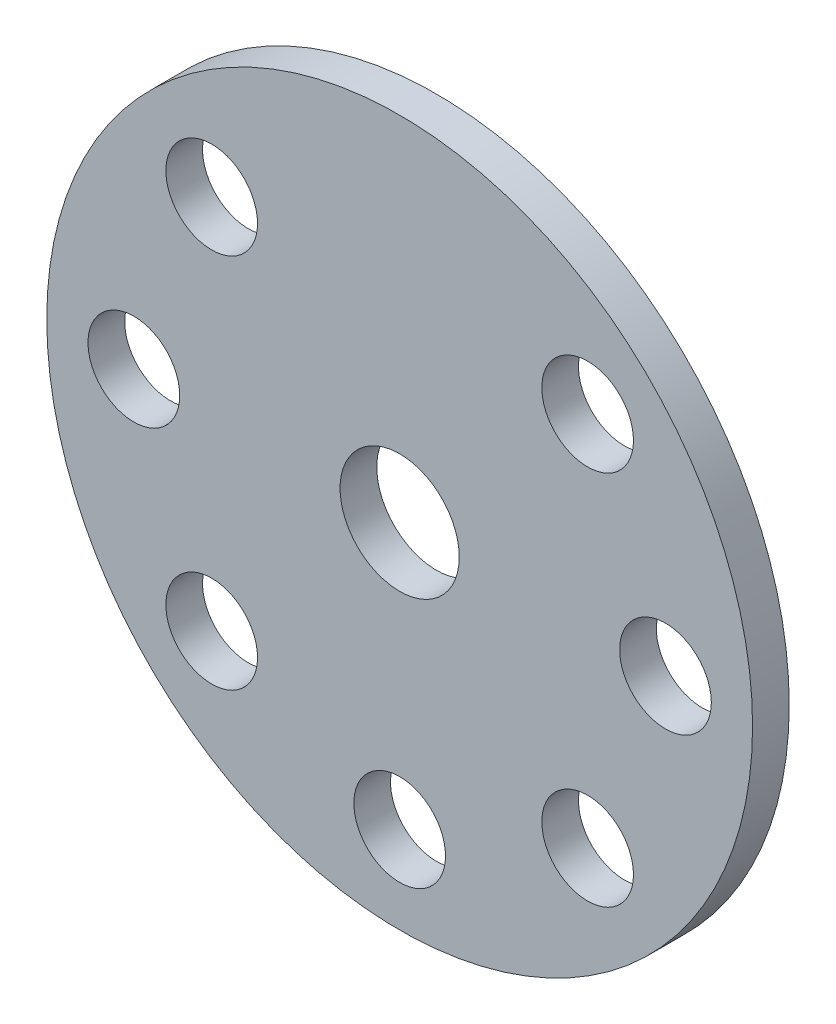
ISO-10303-21;
HEADER;
FILE_DESCRIPTION(('STEP AP214'),'2;1');
FILE_NAME('part.step','',(''),(''),'','','');
FILE_SCHEMA(('AUTOMOTIVE_DESIGN { 1 0 10303 214 1 1 1 1 }'));
ENDSEC;
DATA;
#1=APPLICATION_CONTEXT('core data for automotive mechanical design processes');
#2=APPLICATION_PROTOCOL_DEFINITION('international standard','automotive_design',2000,#1);
#3=PRODUCT_CONTEXT('',#1,'mechanical');
#4=PRODUCT('Part','Part','',(#3));
#5=PRODUCT_RELATED_PRODUCT_CATEGORY('part','',(#4));
#6=PRODUCT_DEFINITION_FORMATION('','',#4);
#7=PRODUCT_DEFINITION_CONTEXT('part definition',#1,'design');
#8=PRODUCT_DEFINITION('design','',#6,#7);
#9=PRODUCT_DEFINITION_SHAPE('','',#8);
#10=(LENGTH_UNIT() NAMED_UNIT(*) SI_UNIT(.MILLI.,.METRE.));
#11=(NAMED_UNIT(*) PLANE_ANGLE_UNIT() SI_UNIT($,.RADIAN.));
#12=(NAMED_UNIT(*) SI_UNIT($,.STERADIAN.) SOLID_ANGLE_UNIT());
#13=UNCERTAINTY_MEASURE_WITH_UNIT(LENGTH_MEASURE(1.E-05),#10,'distance_accuracy_value','');
#14=(GEOMETRIC_REPRESENTATION_CONTEXT(3) GLOBAL_UNCERTAINTY_ASSIGNED_CONTEXT((#13)) GLOBAL_UNIT_ASSIGNED_CONTEXT((#10,
#11,#12)) REPRESENTATION_CONTEXT('',''));
#15=CARTESIAN_POINT('',(0.,0.,0.));
#16=DIRECTION('',(0.,0.,1.));
#17=DIRECTION('',(1.,0.,0.));
#18=AXIS2_PLACEMENT_3D('',#15,#16,#17);
#19=CARTESIAN_POINT('',(0.,0.,2.));
#20=DIRECTION('',(0.,0.,-1.));
#21=DIRECTION('',(-1.,0.,0.));
#22=AXIS2_PLACEMENT_3D('',#19,#20,#21);
#23=CYLINDRICAL_SURFACE('',#22,19.25);
#24=CARTESIAN_POINT('',(0.,0.,2.));
#25=DIRECTION('',(0.,0.,1.));
#26=DIRECTION('',(1.,0.,0.));
#27=AXIS2_PLACEMENT_3D('',#24,#25,#26);
#28=CIRCLE('',#27,19.25);
#29=CARTESIAN_POINT('',(19.25,0.,2.));
#30=VERTEX_POINT('',#29);
#31=EDGE_CURVE('E10',#30,#30,#28,.T.);
#32=ORIENTED_EDGE('',*,*,#31,.F.);
#33=EDGE_LOOP('',(#32));
#34=FACE_BOUND('',#33,.T.);
#35=CARTESIAN_POINT('',(0.,0.,0.));
#36=DIRECTION('',(0.,0.,1.));
#37=DIRECTION('',(1.,0.,0.));
#38=AXIS2_PLACEMENT_3D('',#35,#36,#37);
#39=CIRCLE('',#38,19.25);
#40=CARTESIAN_POINT('',(19.25,0.,0.));
#41=VERTEX_POINT('',#40);
#42=EDGE_CURVE('E37',#41,#41,#39,.T.);
#43=ORIENTED_EDGE('',*,*,#42,.T.);
#44=EDGE_LOOP('',(#43));
#45=FACE_BOUND('',#44,.T.);
#46=ADVANCED_FACE('F34',(#34,#45),#23,.T.);
#47=CARTESIAN_POINT('',(0.,0.,2.));
#48=DIRECTION('',(0.,0.,1.));
#49=DIRECTION('',(1.,0.,0.));
#50=AXIS2_PLACEMENT_3D('',#47,#48,#49);
#51=PLANE('',#50);
#52=CARTESIAN_POINT('',(0.,0.,2.));
#53=DIRECTION('',(0.,0.,1.));
#54=DIRECTION('',(1.,0.,0.));
#55=AXIS2_PLACEMENT_3D('',#52,#53,#54);
#56=CIRCLE('',#55,3.25);
#57=CARTESIAN_POINT('',(3.25,0.,2.));
#58=VERTEX_POINT('',#57);
#59=EDGE_CURVE('E101',#58,#58,#56,.T.);
#60=ORIENTED_EDGE('',*,*,#59,.F.);
#61=EDGE_LOOP('',(#60));
#62=FACE_BOUND('',#61,.T.);
#63=CARTESIAN_POINT('',(10.2530483272049,10.2530483272049,2.));
#64=DIRECTION('',(0.,0.,1.));
#65=DIRECTION('',(1.,0.,0.));
#66=AXIS2_PLACEMENT_3D('',#63,#64,#65);
#67=CIRCLE('',#66,2.5);
#68=CARTESIAN_POINT('',(12.7530483272049,10.2530483272049,2.));
#69=VERTEX_POINT('',#68);
#70=EDGE_CURVE('E93',#69,#69,#67,.T.);
#71=ORIENTED_EDGE('',*,*,#70,.F.);
#72=EDGE_LOOP('',(#71));
#73=FACE_BOUND('',#72,.T.);
#74=CARTESIAN_POINT('',(14.5,0.,2.));
#75=DIRECTION('',(0.,0.,1.));
#76=DIRECTION('',(1.,0.,0.));
#77=AXIS2_PLACEMENT_3D('',#74,#75,#76);
#78=CIRCLE('',#77,2.5);
#79=CARTESIAN_POINT('',(17.,0.,2.));
#80=VERTEX_POINT('',#79);
#81=EDGE_CURVE('E87',#80,#80,#78,.T.);
#82=ORIENTED_EDGE('',*,*,#81,.F.);
#83=EDGE_LOOP('',(#82));
#84=FACE_BOUND('',#83,.T.);
#85=CARTESIAN_POINT('',(10.2530483272049,-10.2530483272049,2.));
#86=DIRECTION('',(0.,0.,1.));
#87=DIRECTION('',(1.,0.,0.));
#88=AXIS2_PLACEMENT_3D('',#85,#86,#87);
#89=CIRCLE('',#88,2.5);
#90=CARTESIAN_POINT('',(12.7530483272049,-10.2530483272049,2.));
#91=VERTEX_POINT('',#90);
#92=EDGE_CURVE('E79',#91,#91,#89,.T.);
#93=ORIENTED_EDGE('',*,*,#92,.F.);
#94=EDGE_LOOP('',(#93));
#95=FACE_BOUND('',#94,.T.);
#96=CARTESIAN_POINT('',(0.,-14.5,2.));
#97=DIRECTION('',(0.,0.,1.));
#98=DIRECTION('',(1.,0.,0.));
#99=AXIS2_PLACEMENT_3D('',#96,#97,#98);
#100=CIRCLE('',#99,2.5);
#101=CARTESIAN_POINT('',(2.50000000000001,-14.5,2.));
#102=VERTEX_POINT('',#101);
#103=EDGE_CURVE('E73',#102,#102,#100,.T.);
#104=ORIENTED_EDGE('',*,*,#103,.F.);
#105=EDGE_LOOP('',(#104));
#106=FACE_BOUND('',#105,.T.);
#107=CARTESIAN_POINT('',(-10.2530483272049,-10.2530483272049,2.));
#108=DIRECTION('',(0.,0.,1.));
#109=DIRECTION('',(1.,0.,0.));
#110=AXIS2_PLACEMENT_3D('',#107,#108,#109);
#111=CIRCLE('',#110,2.5);
#112=CARTESIAN_POINT('',(-7.75304832720493,-10.2530483272049,2.));
#113=VERTEX_POINT('',#112);
#114=EDGE_CURVE('E65',#113,#113,#111,.T.);
#115=ORIENTED_EDGE('',*,*,#114,.F.);
#116=EDGE_LOOP('',(#115));
#117=FACE_BOUND('',#116,.T.);
#118=CARTESIAN_POINT('',(-14.5,0.,2.));
#119=DIRECTION('',(0.,0.,1.));
#120=DIRECTION('',(1.,0.,0.));
#121=AXIS2_PLACEMENT_3D('',#118,#119,#120);
#122=CIRCLE('',#121,2.5);
#123=CARTESIAN_POINT('',(-12.,0.,2.));
#124=VERTEX_POINT('',#123);
#125=EDGE_CURVE('E57',#124,#124,#122,.T.);
#126=ORIENTED_EDGE('',*,*,#125,.F.);
#127=EDGE_LOOP('',(#126));
#128=FACE_BOUND('',#127,.T.);
#129=CARTESIAN_POINT('',(-10.2530483272049,10.2530483272049,2.));
#130=DIRECTION('',(0.,0.,1.));
#131=DIRECTION('',(1.,0.,0.));
#132=AXIS2_PLACEMENT_3D('',#129,#130,#131);
#133=CIRCLE('',#132,2.5);
#134=CARTESIAN_POINT('',(-7.75304832720493,10.2530483272049,2.));
#135=VERTEX_POINT('',#134);
#136=EDGE_CURVE('E51',#135,#135,#133,.T.);
#137=ORIENTED_EDGE('',*,*,#136,.F.);
#138=EDGE_LOOP('',(#137));
#139=FACE_BOUND('',#138,.T.);
#140=ORIENTED_EDGE('',*,*,#31,.T.);
#141=EDGE_LOOP('',(#140));
#142=FACE_BOUND('',#141,.T.);
#143=ADVANCED_FACE('F118',(#62,#73,#84,#95,#106,#117,#128,#139,#142),#51,.T.);
#144=CARTESIAN_POINT('',(0.,0.,0.));
#145=DIRECTION('',(0.,0.,1.));
#146=DIRECTION('',(1.,0.,0.));
#147=AXIS2_PLACEMENT_3D('',#144,#145,#146);
#148=PLANE('',#147);
#149=CARTESIAN_POINT('',(0.,0.,0.));
#150=DIRECTION('',(0.,0.,1.));
#151=DIRECTION('',(1.,0.,0.));
#152=AXIS2_PLACEMENT_3D('',#149,#150,#151);
#153=CIRCLE('',#152,3.25);
#154=CARTESIAN_POINT('',(3.25,0.,0.));
#155=VERTEX_POINT('',#154);
#156=EDGE_CURVE('E97',#155,#155,#153,.T.);
#157=ORIENTED_EDGE('',*,*,#156,.T.);
#158=EDGE_LOOP('',(#157));
#159=FACE_BOUND('',#158,.T.);
#160=CARTESIAN_POINT('',(10.2530483272049,10.2530483272049,0.));
#161=DIRECTION('',(0.,0.,1.));
#162=DIRECTION('',(1.,0.,0.));
#163=AXIS2_PLACEMENT_3D('',#160,#161,#162);
#164=CIRCLE('',#163,2.5);
#165=CARTESIAN_POINT('',(12.7530483272049,10.2530483272049,0.));
#166=VERTEX_POINT('',#165);
#167=EDGE_CURVE('E90',#166,#166,#164,.T.);
#168=ORIENTED_EDGE('',*,*,#167,.T.);
#169=EDGE_LOOP('',(#168));
#170=FACE_BOUND('',#169,.T.);
#171=CARTESIAN_POINT('',(14.5,0.,0.));
#172=DIRECTION('',(0.,0.,1.));
#173=DIRECTION('',(1.,0.,0.));
#174=AXIS2_PLACEMENT_3D('',#171,#172,#173);
#175=CIRCLE('',#174,2.5);
#176=CARTESIAN_POINT('',(17.,0.,0.));
#177=VERTEX_POINT('',#176);
#178=EDGE_CURVE('E83',#177,#177,#175,.T.);
#179=ORIENTED_EDGE('',*,*,#178,.T.);
#180=EDGE_LOOP('',(#179));
#181=FACE_BOUND('',#180,.T.);
#182=CARTESIAN_POINT('',(10.2530483272049,-10.2530483272049,0.));
#183=DIRECTION('',(0.,0.,1.));
#184=DIRECTION('',(1.,0.,0.));
#185=AXIS2_PLACEMENT_3D('',#182,#183,#184);
#186=CIRCLE('',#185,2.5);
#187=CARTESIAN_POINT('',(12.7530483272049,-10.2530483272049,0.));
#188=VERTEX_POINT('',#187);
#189=EDGE_CURVE('E76',#188,#188,#186,.T.);
#190=ORIENTED_EDGE('',*,*,#189,.T.);
#191=EDGE_LOOP('',(#190));
#192=FACE_BOUND('',#191,.T.);
#193=CARTESIAN_POINT('',(0.,-14.5,0.));
#194=DIRECTION('',(0.,0.,1.));
#195=DIRECTION('',(1.,0.,0.));
#196=AXIS2_PLACEMENT_3D('',#193,#194,#195);
#197=CIRCLE('',#196,2.5);
#198=CARTESIAN_POINT('',(2.50000000000001,-14.5,0.));
#199=VERTEX_POINT('',#198);
#200=EDGE_CURVE('E69',#199,#199,#197,.T.);
#201=ORIENTED_EDGE('',*,*,#200,.T.);
#202=EDGE_LOOP('',(#201));
#203=FACE_BOUND('',#202,.T.);
#204=CARTESIAN_POINT('',(-10.2530483272049,-10.2530483272049,0.));
#205=DIRECTION('',(0.,0.,1.));
#206=DIRECTION('',(1.,0.,0.));
#207=AXIS2_PLACEMENT_3D('',#204,#205,#206);
#208=CIRCLE('',#207,2.5);
#209=CARTESIAN_POINT('',(-7.75304832720493,-10.2530483272049,0.));
#210=VERTEX_POINT('',#209);
#211=EDGE_CURVE('E61',#210,#210,#208,.T.);
#212=ORIENTED_EDGE('',*,*,#211,.T.);
#213=EDGE_LOOP('',(#212));
#214=FACE_BOUND('',#213,.T.);
#215=CARTESIAN_POINT('',(-14.5,0.,0.));
#216=DIRECTION('',(0.,0.,1.));
#217=DIRECTION('',(1.,0.,0.));
#218=AXIS2_PLACEMENT_3D('',#215,#216,#217);
#219=CIRCLE('',#218,2.5);
#220=CARTESIAN_POINT('',(-12.,0.,0.));
#221=VERTEX_POINT('',#220);
#222=EDGE_CURVE('E54',#221,#221,#219,.T.);
#223=ORIENTED_EDGE('',*,*,#222,.T.);
#224=EDGE_LOOP('',(#223));
#225=FACE_BOUND('',#224,.T.);
#226=CARTESIAN_POINT('',(-10.2530483272049,10.2530483272049,0.));
#227=DIRECTION('',(0.,0.,1.));
#228=DIRECTION('',(1.,0.,0.));
#229=AXIS2_PLACEMENT_3D('',#226,#227,#228);
#230=CIRCLE('',#229,2.5);
#231=CARTESIAN_POINT('',(-7.75304832720493,10.2530483272049,0.));
#232=VERTEX_POINT('',#231);
#233=EDGE_CURVE('E49',#232,#232,#230,.T.);
#234=ORIENTED_EDGE('',*,*,#233,.T.);
#235=EDGE_LOOP('',(#234));
#236=FACE_BOUND('',#235,.T.);
#237=ORIENTED_EDGE('',*,*,#42,.F.);
#238=EDGE_LOOP('',(#237));
#239=FACE_BOUND('',#238,.T.);
#240=ADVANCED_FACE('F108',(#159,#170,#181,#192,#203,#214,#225,#236,#239),#148,.F.);
#241=CARTESIAN_POINT('',(-10.2530483272049,10.2530483272049,0.));
#242=DIRECTION('',(0.,0.,1.));
#243=DIRECTION('',(1.,0.,0.));
#244=AXIS2_PLACEMENT_3D('',#241,#242,#243);
#245=CYLINDRICAL_SURFACE('',#244,2.5);
#246=ORIENTED_EDGE('',*,*,#233,.F.);
#247=EDGE_LOOP('',(#246));
#248=FACE_BOUND('',#247,.T.);
#249=ORIENTED_EDGE('',*,*,#136,.T.);
#250=EDGE_LOOP('',(#249));
#251=FACE_BOUND('',#250,.T.);
#252=ADVANCED_FACE('F136',(#248,#251),#245,.F.);
#253=CARTESIAN_POINT('',(-14.5,0.,0.));
#254=DIRECTION('',(0.,0.,1.));
#255=DIRECTION('',(1.,0.,0.));
#256=AXIS2_PLACEMENT_3D('',#253,#254,#255);
#257=CYLINDRICAL_SURFACE('',#256,2.5);
#258=ORIENTED_EDGE('',*,*,#222,.F.);
#259=EDGE_LOOP('',(#258));
#260=FACE_BOUND('',#259,.T.);
#261=ORIENTED_EDGE('',*,*,#125,.T.);
#262=EDGE_LOOP('',(#261));
#263=FACE_BOUND('',#262,.T.);
#264=ADVANCED_FACE('F138',(#260,#263),#257,.F.);
#265=CARTESIAN_POINT('',(-10.2530483272049,-10.2530483272049,0.));
#266=DIRECTION('',(0.,0.,1.));
#267=DIRECTION('',(1.,0.,0.));
#268=AXIS2_PLACEMENT_3D('',#265,#266,#267);
#269=CYLINDRICAL_SURFACE('',#268,2.5);
#270=ORIENTED_EDGE('',*,*,#211,.F.);
#271=EDGE_LOOP('',(#270));
#272=FACE_BOUND('',#271,.T.);
#273=ORIENTED_EDGE('',*,*,#114,.T.);
#274=EDGE_LOOP('',(#273));
#275=FACE_BOUND('',#274,.T.);
#276=ADVANCED_FACE('F145',(#272,#275),#269,.F.);
#277=CARTESIAN_POINT('',(0.,-14.5,0.));
#278=DIRECTION('',(0.,0.,1.));
#279=DIRECTION('',(1.,0.,0.));
#280=AXIS2_PLACEMENT_3D('',#277,#278,#279);
#281=CYLINDRICAL_SURFACE('',#280,2.5);
#282=ORIENTED_EDGE('',*,*,#200,.F.);
#283=EDGE_LOOP('',(#282));
#284=FACE_BOUND('',#283,.T.);
#285=ORIENTED_EDGE('',*,*,#103,.T.);
#286=EDGE_LOOP('',(#285));
#287=FACE_BOUND('',#286,.T.);
#288=ADVANCED_FACE('F187',(#284,#287),#281,.F.);
#289=CARTESIAN_POINT('',(10.2530483272049,-10.2530483272049,0.));
#290=DIRECTION('',(0.,0.,1.));
#291=DIRECTION('',(1.,0.,0.));
#292=AXIS2_PLACEMENT_3D('',#289,#290,#291);
#293=CYLINDRICAL_SURFACE('',#292,2.5);
#294=ORIENTED_EDGE('',*,*,#189,.F.);
#295=EDGE_LOOP('',(#294));
#296=FACE_BOUND('',#295,.T.);
#297=ORIENTED_EDGE('',*,*,#92,.T.);
#298=EDGE_LOOP('',(#297));
#299=FACE_BOUND('',#298,.T.);
#300=ADVANCED_FACE('F197',(#296,#299),#293,.F.);
#301=CARTESIAN_POINT('',(14.5,0.,0.));
#302=DIRECTION('',(0.,0.,1.));
#303=DIRECTION('',(1.,0.,0.));
#304=AXIS2_PLACEMENT_3D('',#301,#302,#303);
#305=CYLINDRICAL_SURFACE('',#304,2.5);
#306=ORIENTED_EDGE('',*,*,#178,.F.);
#307=EDGE_LOOP('',(#306));
#308=FACE_BOUND('',#307,.T.);
#309=ORIENTED_EDGE('',*,*,#81,.T.);
#310=EDGE_LOOP('',(#309));
#311=FACE_BOUND('',#310,.T.);
#312=ADVANCED_FACE('F207',(#308,#311),#305,.F.);
#313=CARTESIAN_POINT('',(10.2530483272049,10.2530483272049,0.));
#314=DIRECTION('',(0.,0.,1.));
#315=DIRECTION('',(1.,0.,0.));
#316=AXIS2_PLACEMENT_3D('',#313,#314,#315);
#317=CYLINDRICAL_SURFACE('',#316,2.5);
#318=ORIENTED_EDGE('',*,*,#167,.F.);
#319=EDGE_LOOP('',(#318));
#320=FACE_BOUND('',#319,.T.);
#321=ORIENTED_EDGE('',*,*,#70,.T.);
#322=EDGE_LOOP('',(#321));
#323=FACE_BOUND('',#322,.T.);
#324=ADVANCED_FACE('F114',(#320,#323),#317,.F.);
#325=CARTESIAN_POINT('',(0.,0.,0.));
#326=DIRECTION('',(0.,0.,1.));
#327=DIRECTION('',(1.,0.,0.));
#328=AXIS2_PLACEMENT_3D('',#325,#326,#327);
#329=CYLINDRICAL_SURFACE('',#328,3.25);
#330=ORIENTED_EDGE('',*,*,#156,.F.);
#331=EDGE_LOOP('',(#330));
#332=FACE_BOUND('',#331,.T.);
#333=ORIENTED_EDGE('',*,*,#59,.T.);
#334=EDGE_LOOP('',(#333));
#335=FACE_BOUND('',#334,.T.);
#336=ADVANCED_FACE('F111',(#332,#335),#329,.F.);
#337=CLOSED_SHELL('',(#46,#143,#240,#252,#264,#276,#288,#300,#312,#324,#336));
#338=MANIFOLD_SOLID_BREP('B2',#337);
#339=ADVANCED_BREP_SHAPE_REPRESENTATION('',(#18,#338),#14);
#340=SHAPE_DEFINITION_REPRESENTATION(#9,#339);
ENDSEC;
END-ISO-10303-21;
